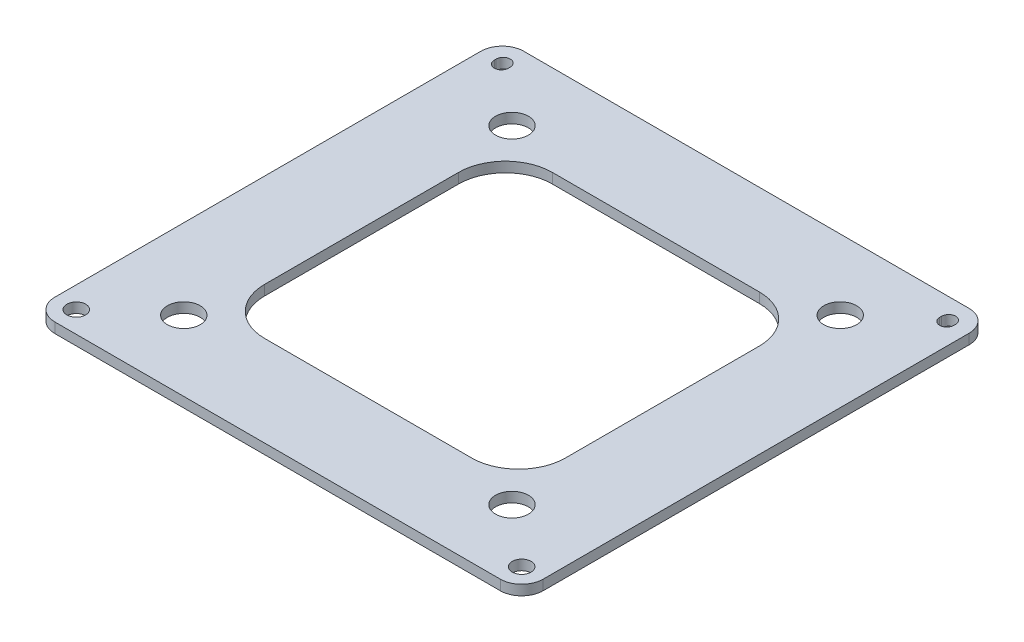
ISO-10303-21;
HEADER;
FILE_DESCRIPTION(('STEP AP214'),'2;1');
FILE_NAME('part.step','',(''),(''),'','','');
FILE_SCHEMA(('AUTOMOTIVE_DESIGN { 1 0 10303 214 1 1 1 1 }'));
ENDSEC;
DATA;
#1=APPLICATION_CONTEXT('core data for automotive mechanical design processes');
#2=APPLICATION_PROTOCOL_DEFINITION('international standard','automotive_design',2000,#1);
#3=PRODUCT_CONTEXT('',#1,'mechanical');
#4=PRODUCT('Part','Part','',(#3));
#5=PRODUCT_RELATED_PRODUCT_CATEGORY('part','',(#4));
#6=PRODUCT_DEFINITION_FORMATION('','',#4);
#7=PRODUCT_DEFINITION_CONTEXT('part definition',#1,'design');
#8=PRODUCT_DEFINITION('design','',#6,#7);
#9=PRODUCT_DEFINITION_SHAPE('','',#8);
#10=(LENGTH_UNIT() NAMED_UNIT(*) SI_UNIT(.MILLI.,.METRE.));
#11=(NAMED_UNIT(*) PLANE_ANGLE_UNIT() SI_UNIT($,.RADIAN.));
#12=(NAMED_UNIT(*) SI_UNIT($,.STERADIAN.) SOLID_ANGLE_UNIT());
#13=UNCERTAINTY_MEASURE_WITH_UNIT(LENGTH_MEASURE(1.E-05),#10,'distance_accuracy_value','');
#14=(GEOMETRIC_REPRESENTATION_CONTEXT(3) GLOBAL_UNCERTAINTY_ASSIGNED_CONTEXT((#13)) GLOBAL_UNIT_ASSIGNED_CONTEXT((#10,
#11,#12)) REPRESENTATION_CONTEXT('',''));
#15=CARTESIAN_POINT('',(0.,0.,0.));
#16=DIRECTION('',(0.,0.,1.));
#17=DIRECTION('',(1.,0.,0.));
#18=AXIS2_PLACEMENT_3D('',#15,#16,#17);
#19=CARTESIAN_POINT('',(-47.5,2.15,45.425));
#20=DIRECTION('',(0.,1.,0.));
#21=DIRECTION('',(0.,0.,1.));
#22=AXIS2_PLACEMENT_3D('',#19,#20,#21);
#23=PLANE('',#22);
#24=CARTESIAN_POINT('',(35.,2.15,35.));
#25=DIRECTION('',(0.,1.,0.));
#26=DIRECTION('',(0.,0.,1.));
#27=AXIS2_PLACEMENT_3D('',#24,#25,#26);
#28=CIRCLE('',#27,3.5);
#29=CARTESIAN_POINT('',(35.,2.15,38.5));
#30=VERTEX_POINT('',#29);
#31=EDGE_CURVE('E764',#30,#30,#28,.T.);
#32=ORIENTED_EDGE('',*,*,#31,.F.);
#33=EDGE_LOOP('',(#32));
#34=FACE_BOUND('',#33,.T.);
#35=CARTESIAN_POINT('',(-35.,2.15,-35.));
#36=DIRECTION('',(0.,1.,0.));
#37=DIRECTION('',(0.,0.,1.));
#38=AXIS2_PLACEMENT_3D('',#35,#36,#37);
#39=CIRCLE('',#38,3.5);
#40=CARTESIAN_POINT('',(-35.,2.15,-31.5));
#41=VERTEX_POINT('',#40);
#42=EDGE_CURVE('E249',#41,#41,#39,.T.);
#43=ORIENTED_EDGE('',*,*,#42,.F.);
#44=EDGE_LOOP('',(#43));
#45=FACE_BOUND('',#44,.T.);
#46=CARTESIAN_POINT('',(47.5,2.15,45.425));
#47=DIRECTION('',(0.,1.,0.));
#48=DIRECTION('',(0.,0.,1.));
#49=AXIS2_PLACEMENT_3D('',#46,#47,#48);
#50=CIRCLE('',#49,2.);
#51=CARTESIAN_POINT('',(47.5,2.15,47.425));
#52=VERTEX_POINT('',#51);
#53=EDGE_CURVE('E344',#52,#52,#50,.T.);
#54=ORIENTED_EDGE('',*,*,#53,.F.);
#55=EDGE_LOOP('',(#54));
#56=FACE_BOUND('',#55,.T.);
#57=CARTESIAN_POINT('',(-47.5,2.15,45.425));
#58=DIRECTION('',(0.,1.,0.));
#59=DIRECTION('',(0.,0.,1.));
#60=AXIS2_PLACEMENT_3D('',#57,#58,#59);
#61=CIRCLE('',#60,4.57499999999999);
#62=CARTESIAN_POINT('',(-52.075,2.15,45.425));
#63=VERTEX_POINT('',#62);
#64=CARTESIAN_POINT('',(-47.5,2.15,50.));
#65=VERTEX_POINT('',#64);
#66=EDGE_CURVE('E395',#63,#65,#61,.T.);
#67=ORIENTED_EDGE('',*,*,#66,.T.);
#68=DIRECTION('',(1.,0.,0.));
#69=VECTOR('',#68,1.);
#70=CARTESIAN_POINT('',(-47.5,2.15,50.));
#71=LINE('',#70,#69);
#72=CARTESIAN_POINT('',(47.5,2.15,50.));
#73=VERTEX_POINT('',#72);
#74=EDGE_CURVE('E399',#65,#73,#71,.T.);
#75=ORIENTED_EDGE('',*,*,#74,.T.);
#76=CARTESIAN_POINT('',(47.5,2.15,45.425));
#77=DIRECTION('',(0.,1.,0.));
#78=DIRECTION('',(0.,0.,1.));
#79=AXIS2_PLACEMENT_3D('',#76,#77,#78);
#80=CIRCLE('',#79,4.575);
#81=CARTESIAN_POINT('',(52.075,2.15,45.425));
#82=VERTEX_POINT('',#81);
#83=EDGE_CURVE('E403',#73,#82,#80,.T.);
#84=ORIENTED_EDGE('',*,*,#83,.T.);
#85=DIRECTION('',(0.,0.,-1.));
#86=VECTOR('',#85,1.);
#87=CARTESIAN_POINT('',(52.075,2.15,-45.425));
#88=LINE('',#87,#86);
#89=CARTESIAN_POINT('',(52.075,2.15,-45.425));
#90=VERTEX_POINT('',#89);
#91=EDGE_CURVE('E406',#82,#90,#88,.T.);
#92=ORIENTED_EDGE('',*,*,#91,.T.);
#93=CARTESIAN_POINT('',(47.5,2.15,-45.425));
#94=DIRECTION('',(0.,1.,0.));
#95=DIRECTION('',(0.,0.,1.));
#96=AXIS2_PLACEMENT_3D('',#93,#94,#95);
#97=CIRCLE('',#96,4.575);
#98=CARTESIAN_POINT('',(47.5,2.15,-50.));
#99=VERTEX_POINT('',#98);
#100=EDGE_CURVE('E409',#90,#99,#97,.T.);
#101=ORIENTED_EDGE('',*,*,#100,.T.);
#102=DIRECTION('',(-1.,0.,0.));
#103=VECTOR('',#102,1.);
#104=CARTESIAN_POINT('',(-47.5,2.15,-50.));
#105=LINE('',#104,#103);
#106=CARTESIAN_POINT('',(-47.5,2.15,-50.));
#107=VERTEX_POINT('',#106);
#108=EDGE_CURVE('E412',#99,#107,#105,.T.);
#109=ORIENTED_EDGE('',*,*,#108,.T.);
#110=CARTESIAN_POINT('',(-47.5,2.15,-45.425));
#111=DIRECTION('',(0.,1.,0.));
#112=DIRECTION('',(0.,0.,1.));
#113=AXIS2_PLACEMENT_3D('',#110,#111,#112);
#114=CIRCLE('',#113,4.57500000000001);
#115=CARTESIAN_POINT('',(-52.075,2.15,-45.425));
#116=VERTEX_POINT('',#115);
#117=EDGE_CURVE('E415',#107,#116,#114,.T.);
#118=ORIENTED_EDGE('',*,*,#117,.T.);
#119=DIRECTION('',(0.,0.,1.));
#120=VECTOR('',#119,1.);
#121=CARTESIAN_POINT('',(-52.075,2.15,-45.425));
#122=LINE('',#121,#120);
#123=EDGE_CURVE('E418',#116,#63,#122,.T.);
#124=ORIENTED_EDGE('',*,*,#123,.T.);
#125=EDGE_LOOP('',(#67,#75,#84,#92,#101,#109,#118,#124));
#126=FACE_BOUND('',#125,.T.);
#127=DIRECTION('',(0.,0.,1.));
#128=VECTOR('',#127,1.);
#129=CARTESIAN_POINT('',(-49.,2.15,-45.225));
#130=LINE('',#129,#128);
#131=CARTESIAN_POINT('',(-49.,2.15,-45.625));
#132=VERTEX_POINT('',#131);
#133=CARTESIAN_POINT('',(-49.,2.15,-45.225));
#134=VERTEX_POINT('',#133);
#135=EDGE_CURVE('E355',#132,#134,#130,.T.);
#136=ORIENTED_EDGE('',*,*,#135,.F.);
#137=CARTESIAN_POINT('',(-47.5,2.15,-45.625));
#138=DIRECTION('',(0.,1.,0.));
#139=DIRECTION('',(0.,0.,1.));
#140=AXIS2_PLACEMENT_3D('',#137,#138,#139);
#141=CIRCLE('',#140,1.5);
#142=CARTESIAN_POINT('',(-46.,2.15,-45.625));
#143=VERTEX_POINT('',#142);
#144=EDGE_CURVE('E352',#143,#132,#141,.T.);
#145=ORIENTED_EDGE('',*,*,#144,.F.);
#146=DIRECTION('',(0.,0.,-1.));
#147=VECTOR('',#146,1.);
#148=CARTESIAN_POINT('',(-46.,2.15,-45.225));
#149=LINE('',#148,#147);
#150=CARTESIAN_POINT('',(-46.,2.15,-45.225));
#151=VERTEX_POINT('',#150);
#152=EDGE_CURVE('E363',#151,#143,#149,.T.);
#153=ORIENTED_EDGE('',*,*,#152,.F.);
#154=CARTESIAN_POINT('',(-47.5,2.15,-45.225));
#155=DIRECTION('',(0.,1.,0.));
#156=DIRECTION('',(0.,0.,1.));
#157=AXIS2_PLACEMENT_3D('',#154,#155,#156);
#158=CIRCLE('',#157,1.5);
#159=EDGE_CURVE('E359',#134,#151,#158,.T.);
#160=ORIENTED_EDGE('',*,*,#159,.F.);
#161=EDGE_LOOP('',(#136,#145,#153,#160));
#162=FACE_BOUND('',#161,.T.);
#163=CARTESIAN_POINT('',(-47.5,2.15,45.425));
#164=DIRECTION('',(0.,1.,0.));
#165=DIRECTION('',(0.,0.,1.));
#166=AXIS2_PLACEMENT_3D('',#163,#164,#165);
#167=CIRCLE('',#166,2.);
#168=CARTESIAN_POINT('',(-47.5,2.15,47.425));
#169=VERTEX_POINT('',#168);
#170=EDGE_CURVE('E336',#169,#169,#167,.T.);
#171=ORIENTED_EDGE('',*,*,#170,.F.);
#172=EDGE_LOOP('',(#171));
#173=FACE_BOUND('',#172,.T.);
#174=DIRECTION('',(0.,0.,1.));
#175=VECTOR('',#174,1.);
#176=CARTESIAN_POINT('',(46.,2.15,-45.225));
#177=LINE('',#176,#175);
#178=CARTESIAN_POINT('',(46.,2.15,-45.625));
#179=VERTEX_POINT('',#178);
#180=CARTESIAN_POINT('',(46.,2.15,-45.225));
#181=VERTEX_POINT('',#180);
#182=EDGE_CURVE('E296',#179,#181,#177,.T.);
#183=ORIENTED_EDGE('',*,*,#182,.F.);
#184=CARTESIAN_POINT('',(47.5,2.15,-45.625));
#185=DIRECTION('',(0.,1.,0.));
#186=DIRECTION('',(0.,0.,-1.));
#187=AXIS2_PLACEMENT_3D('',#184,#185,#186);
#188=CIRCLE('',#187,1.5);
#189=CARTESIAN_POINT('',(49.,2.15,-45.625));
#190=VERTEX_POINT('',#189);
#191=EDGE_CURVE('E293',#190,#179,#188,.T.);
#192=ORIENTED_EDGE('',*,*,#191,.F.);
#193=DIRECTION('',(0.,0.,-1.));
#194=VECTOR('',#193,1.);
#195=CARTESIAN_POINT('',(49.,2.15,-45.225));
#196=LINE('',#195,#194);
#197=CARTESIAN_POINT('',(49.,2.15,-45.225));
#198=VERTEX_POINT('',#197);
#199=EDGE_CURVE('E304',#198,#190,#196,.T.);
#200=ORIENTED_EDGE('',*,*,#199,.F.);
#201=CARTESIAN_POINT('',(47.5,2.15,-45.225));
#202=DIRECTION('',(0.,1.,0.));
#203=DIRECTION('',(0.,0.,-1.));
#204=AXIS2_PLACEMENT_3D('',#201,#202,#203);
#205=CIRCLE('',#204,1.5);
#206=EDGE_CURVE('E300',#181,#198,#205,.T.);
#207=ORIENTED_EDGE('',*,*,#206,.F.);
#208=EDGE_LOOP('',(#183,#192,#200,#207));
#209=FACE_BOUND('',#208,.T.);
#210=DIRECTION('',(1.,0.,0.));
#211=VECTOR('',#210,1.);
#212=CARTESIAN_POINT('',(-22.0749999999999,2.15,30.6738289473684));
#213=LINE('',#212,#211);
#214=CARTESIAN_POINT('',(-22.0749999999999,2.15,30.6738289473684));
#215=VERTEX_POINT('',#214);
#216=CARTESIAN_POINT('',(22.0749999999999,2.15,30.6738289473684));
#217=VERTEX_POINT('',#216);
#218=EDGE_CURVE('E210',#215,#217,#213,.T.);
#219=ORIENTED_EDGE('',*,*,#218,.F.);
#220=CARTESIAN_POINT('',(-22.075,2.15,20.6738289473684));
#221=DIRECTION('',(0.,1.,0.));
#222=DIRECTION('',(0.,0.,-1.));
#223=AXIS2_PLACEMENT_3D('',#220,#221,#222);
#224=CIRCLE('',#223,10.);
#225=CARTESIAN_POINT('',(-32.075,2.15,20.6738289473684));
#226=VERTEX_POINT('',#225);
#227=EDGE_CURVE('E201',#226,#215,#224,.T.);
#228=ORIENTED_EDGE('',*,*,#227,.F.);
#229=DIRECTION('',(0.,0.,1.));
#230=VECTOR('',#229,1.);
#231=CARTESIAN_POINT('',(-32.075,2.15,20.6738289473684));
#232=LINE('',#231,#230);
#233=CARTESIAN_POINT('',(-32.075,2.15,-20.6738289473683));
#234=VERTEX_POINT('',#233);
#235=EDGE_CURVE('E244',#234,#226,#232,.T.);
#236=ORIENTED_EDGE('',*,*,#235,.F.);
#237=CARTESIAN_POINT('',(-22.075,2.15,-20.6738289473684));
#238=DIRECTION('',(0.,1.,0.));
#239=DIRECTION('',(0.,0.,-1.));
#240=AXIS2_PLACEMENT_3D('',#237,#238,#239);
#241=CIRCLE('',#240,10.);
#242=CARTESIAN_POINT('',(-22.0749999999999,2.15,-30.6738289473684));
#243=VERTEX_POINT('',#242);
#244=EDGE_CURVE('E241',#243,#234,#241,.T.);
#245=ORIENTED_EDGE('',*,*,#244,.F.);
#246=DIRECTION('',(-1.,0.,0.));
#247=VECTOR('',#246,1.);
#248=CARTESIAN_POINT('',(-22.0749999999999,2.15,-30.6738289473684));
#249=LINE('',#248,#247);
#250=CARTESIAN_POINT('',(22.0749999999999,2.15,-30.6738289473684));
#251=VERTEX_POINT('',#250);
#252=EDGE_CURVE('E238',#251,#243,#249,.T.);
#253=ORIENTED_EDGE('',*,*,#252,.F.);
#254=CARTESIAN_POINT('',(22.075,2.15,-20.6738289473684));
#255=DIRECTION('',(0.,1.,0.));
#256=DIRECTION('',(0.,0.,-1.));
#257=AXIS2_PLACEMENT_3D('',#254,#255,#256);
#258=CIRCLE('',#257,10.);
#259=CARTESIAN_POINT('',(32.075,2.15,-20.6738289473683));
#260=VERTEX_POINT('',#259);
#261=EDGE_CURVE('E235',#260,#251,#258,.T.);
#262=ORIENTED_EDGE('',*,*,#261,.F.);
#263=DIRECTION('',(0.,0.,-1.));
#264=VECTOR('',#263,1.);
#265=CARTESIAN_POINT('',(32.075,2.15,20.6738289473684));
#266=LINE('',#265,#264);
#267=CARTESIAN_POINT('',(32.075,2.15,20.6738289473684));
#268=VERTEX_POINT('',#267);
#269=EDGE_CURVE('E229',#268,#260,#266,.T.);
#270=ORIENTED_EDGE('',*,*,#269,.F.);
#271=CARTESIAN_POINT('',(22.075,2.15,20.6738289473684));
#272=DIRECTION('',(0.,1.,0.));
#273=DIRECTION('',(0.,0.,1.));
#274=AXIS2_PLACEMENT_3D('',#271,#272,#273);
#275=CIRCLE('',#274,10.);
#276=EDGE_CURVE('E225',#217,#268,#275,.T.);
#277=ORIENTED_EDGE('',*,*,#276,.F.);
#278=EDGE_LOOP('',(#219,#228,#236,#245,#253,#262,#270,#277));
#279=FACE_BOUND('',#278,.T.);
#280=CARTESIAN_POINT('',(35.,2.15,-35.));
#281=DIRECTION('',(0.,1.,0.));
#282=DIRECTION('',(0.,0.,1.));
#283=AXIS2_PLACEMENT_3D('',#280,#281,#282);
#284=CIRCLE('',#283,3.5);
#285=CARTESIAN_POINT('',(35.,2.15,-31.5));
#286=VERTEX_POINT('',#285);
#287=EDGE_CURVE('E772',#286,#286,#284,.T.);
#288=ORIENTED_EDGE('',*,*,#287,.F.);
#289=EDGE_LOOP('',(#288));
#290=FACE_BOUND('',#289,.T.);
#291=CARTESIAN_POINT('',(-35.,2.15,35.));
#292=DIRECTION('',(0.,1.,0.));
#293=DIRECTION('',(0.,0.,1.));
#294=AXIS2_PLACEMENT_3D('',#291,#292,#293);
#295=CIRCLE('',#294,3.5);
#296=CARTESIAN_POINT('',(-35.,2.15,38.5));
#297=VERTEX_POINT('',#296);
#298=EDGE_CURVE('E753',#297,#297,#295,.T.);
#299=ORIENTED_EDGE('',*,*,#298,.F.);
#300=EDGE_LOOP('',(#299));
#301=FACE_BOUND('',#300,.T.);
#302=ADVANCED_FACE('F39',(#34,#45,#56,#126,#162,#173,#209,#279,#290,#301),#23,.T.);
#303=CARTESIAN_POINT('',(-47.5,0.,45.425));
#304=DIRECTION('',(0.,1.,0.));
#305=DIRECTION('',(0.,0.,1.));
#306=AXIS2_PLACEMENT_3D('',#303,#304,#305);
#307=PLANE('',#306);
#308=CARTESIAN_POINT('',(47.5,0.,-45.625));
#309=DIRECTION('',(0.,1.,0.));
#310=DIRECTION('',(0.,0.,-1.));
#311=AXIS2_PLACEMENT_3D('',#308,#309,#310);
#312=CIRCLE('',#311,1.5);
#313=CARTESIAN_POINT('',(49.,0.,-45.625));
#314=VERTEX_POINT('',#313);
#315=CARTESIAN_POINT('',(46.,0.,-45.625));
#316=VERTEX_POINT('',#315);
#317=EDGE_CURVE('E219',#314,#316,#312,.T.);
#318=ORIENTED_EDGE('',*,*,#317,.T.);
#319=DIRECTION('',(0.,0.,1.));
#320=VECTOR('',#319,1.);
#321=CARTESIAN_POINT('',(46.,0.,-45.225));
#322=LINE('',#321,#320);
#323=CARTESIAN_POINT('',(46.,0.,-45.225));
#324=VERTEX_POINT('',#323);
#325=EDGE_CURVE('E311',#316,#324,#322,.T.);
#326=ORIENTED_EDGE('',*,*,#325,.T.);
#327=CARTESIAN_POINT('',(47.5,0.,-45.225));
#328=DIRECTION('',(0.,1.,0.));
#329=DIRECTION('',(0.,0.,-1.));
#330=AXIS2_PLACEMENT_3D('',#327,#328,#329);
#331=CIRCLE('',#330,1.5);
#332=CARTESIAN_POINT('',(49.,0.,-45.225));
#333=VERTEX_POINT('',#332);
#334=EDGE_CURVE('E315',#324,#333,#331,.T.);
#335=ORIENTED_EDGE('',*,*,#334,.T.);
#336=DIRECTION('',(0.,0.,-1.));
#337=VECTOR('',#336,1.);
#338=CARTESIAN_POINT('',(49.,0.,-45.225));
#339=LINE('',#338,#337);
#340=EDGE_CURVE('E297',#333,#314,#339,.T.);
#341=ORIENTED_EDGE('',*,*,#340,.T.);
#342=EDGE_LOOP('',(#318,#326,#335,#341));
#343=FACE_BOUND('',#342,.T.);
#344=CARTESIAN_POINT('',(-47.5,0.,45.425));
#345=DIRECTION('',(0.,1.,0.));
#346=DIRECTION('',(0.,0.,1.));
#347=AXIS2_PLACEMENT_3D('',#344,#345,#346);
#348=CIRCLE('',#347,4.57499999999999);
#349=CARTESIAN_POINT('',(-52.075,0.,45.425));
#350=VERTEX_POINT('',#349);
#351=CARTESIAN_POINT('',(-47.5,0.,50.));
#352=VERTEX_POINT('',#351);
#353=EDGE_CURVE('E394',#350,#352,#348,.T.);
#354=ORIENTED_EDGE('',*,*,#353,.F.);
#355=DIRECTION('',(0.,0.,1.));
#356=VECTOR('',#355,1.);
#357=CARTESIAN_POINT('',(-52.075,0.,-45.425));
#358=LINE('',#357,#356);
#359=CARTESIAN_POINT('',(-52.075,0.,-45.425));
#360=VERTEX_POINT('',#359);
#361=EDGE_CURVE('E400',#360,#350,#358,.T.);
#362=ORIENTED_EDGE('',*,*,#361,.F.);
#363=CARTESIAN_POINT('',(-47.5,0.,-45.425));
#364=DIRECTION('',(0.,1.,0.));
#365=DIRECTION('',(0.,0.,1.));
#366=AXIS2_PLACEMENT_3D('',#363,#364,#365);
#367=CIRCLE('',#366,4.57500000000001);
#368=CARTESIAN_POINT('',(-47.5,0.,-50.));
#369=VERTEX_POINT('',#368);
#370=EDGE_CURVE('E440',#369,#360,#367,.T.);
#371=ORIENTED_EDGE('',*,*,#370,.F.);
#372=DIRECTION('',(-1.,0.,0.));
#373=VECTOR('',#372,1.);
#374=CARTESIAN_POINT('',(-47.5,0.,-50.));
#375=LINE('',#374,#373);
#376=CARTESIAN_POINT('',(47.5,0.,-50.));
#377=VERTEX_POINT('',#376);
#378=EDGE_CURVE('E437',#377,#369,#375,.T.);
#379=ORIENTED_EDGE('',*,*,#378,.F.);
#380=CARTESIAN_POINT('',(47.5,0.,-45.425));
#381=DIRECTION('',(0.,1.,0.));
#382=DIRECTION('',(0.,0.,1.));
#383=AXIS2_PLACEMENT_3D('',#380,#381,#382);
#384=CIRCLE('',#383,4.575);
#385=CARTESIAN_POINT('',(52.075,0.,-45.425));
#386=VERTEX_POINT('',#385);
#387=EDGE_CURVE('E434',#386,#377,#384,.T.);
#388=ORIENTED_EDGE('',*,*,#387,.F.);
#389=DIRECTION('',(0.,0.,-1.));
#390=VECTOR('',#389,1.);
#391=CARTESIAN_POINT('',(52.075,0.,-45.425));
#392=LINE('',#391,#390);
#393=CARTESIAN_POINT('',(52.075,0.,45.425));
#394=VERTEX_POINT('',#393);
#395=EDGE_CURVE('E431',#394,#386,#392,.T.);
#396=ORIENTED_EDGE('',*,*,#395,.F.);
#397=CARTESIAN_POINT('',(47.5,0.,45.425));
#398=DIRECTION('',(0.,1.,0.));
#399=DIRECTION('',(0.,0.,1.));
#400=AXIS2_PLACEMENT_3D('',#397,#398,#399);
#401=CIRCLE('',#400,4.575);
#402=CARTESIAN_POINT('',(47.5,0.,50.));
#403=VERTEX_POINT('',#402);
#404=EDGE_CURVE('E428',#403,#394,#401,.T.);
#405=ORIENTED_EDGE('',*,*,#404,.F.);
#406=DIRECTION('',(1.,0.,0.));
#407=VECTOR('',#406,1.);
#408=CARTESIAN_POINT('',(-47.5,0.,50.));
#409=LINE('',#408,#407);
#410=EDGE_CURVE('E425',#352,#403,#409,.T.);
#411=ORIENTED_EDGE('',*,*,#410,.F.);
#412=EDGE_LOOP('',(#354,#362,#371,#379,#388,#396,#405,#411));
#413=FACE_BOUND('',#412,.T.);
#414=CARTESIAN_POINT('',(-47.5,0.,-45.625));
#415=DIRECTION('',(0.,1.,0.));
#416=DIRECTION('',(0.,0.,1.));
#417=AXIS2_PLACEMENT_3D('',#414,#415,#416);
#418=CIRCLE('',#417,1.5);
#419=CARTESIAN_POINT('',(-46.,0.,-45.625));
#420=VERTEX_POINT('',#419);
#421=CARTESIAN_POINT('',(-49.,0.,-45.625));
#422=VERTEX_POINT('',#421);
#423=EDGE_CURVE('E348',#420,#422,#418,.T.);
#424=ORIENTED_EDGE('',*,*,#423,.T.);
#425=DIRECTION('',(0.,0.,1.));
#426=VECTOR('',#425,1.);
#427=CARTESIAN_POINT('',(-49.,0.,-45.225));
#428=LINE('',#427,#426);
#429=CARTESIAN_POINT('',(-49.,0.,-45.225));
#430=VERTEX_POINT('',#429);
#431=EDGE_CURVE('E370',#422,#430,#428,.T.);
#432=ORIENTED_EDGE('',*,*,#431,.T.);
#433=CARTESIAN_POINT('',(-47.5,0.,-45.225));
#434=DIRECTION('',(0.,1.,0.));
#435=DIRECTION('',(0.,0.,1.));
#436=AXIS2_PLACEMENT_3D('',#433,#434,#435);
#437=CIRCLE('',#436,1.5);
#438=CARTESIAN_POINT('',(-46.,0.,-45.225));
#439=VERTEX_POINT('',#438);
#440=EDGE_CURVE('E374',#430,#439,#437,.T.);
#441=ORIENTED_EDGE('',*,*,#440,.T.);
#442=DIRECTION('',(0.,0.,-1.));
#443=VECTOR('',#442,1.);
#444=CARTESIAN_POINT('',(-46.,0.,-45.225));
#445=LINE('',#444,#443);
#446=EDGE_CURVE('E356',#439,#420,#445,.T.);
#447=ORIENTED_EDGE('',*,*,#446,.T.);
#448=EDGE_LOOP('',(#424,#432,#441,#447));
#449=FACE_BOUND('',#448,.T.);
#450=CARTESIAN_POINT('',(47.5,0.,45.425));
#451=DIRECTION('',(0.,1.,0.));
#452=DIRECTION('',(0.,0.,1.));
#453=AXIS2_PLACEMENT_3D('',#450,#451,#452);
#454=CIRCLE('',#453,2.);
#455=CARTESIAN_POINT('',(47.5,0.,47.425));
#456=VERTEX_POINT('',#455);
#457=EDGE_CURVE('E340',#456,#456,#454,.T.);
#458=ORIENTED_EDGE('',*,*,#457,.T.);
#459=EDGE_LOOP('',(#458));
#460=FACE_BOUND('',#459,.T.);
#461=CARTESIAN_POINT('',(-47.5,0.,45.425));
#462=DIRECTION('',(0.,1.,0.));
#463=DIRECTION('',(0.,0.,1.));
#464=AXIS2_PLACEMENT_3D('',#461,#462,#463);
#465=CIRCLE('',#464,2.);
#466=CARTESIAN_POINT('',(-47.5,0.,47.425));
#467=VERTEX_POINT('',#466);
#468=EDGE_CURVE('E335',#467,#467,#465,.T.);
#469=ORIENTED_EDGE('',*,*,#468,.T.);
#470=EDGE_LOOP('',(#469));
#471=FACE_BOUND('',#470,.T.);
#472=CARTESIAN_POINT('',(-22.075,0.,20.6738289473684));
#473=DIRECTION('',(0.,1.,0.));
#474=DIRECTION('',(0.,0.,-1.));
#475=AXIS2_PLACEMENT_3D('',#472,#473,#474);
#476=CIRCLE('',#475,10.);
#477=CARTESIAN_POINT('',(-32.075,0.,20.6738289473684));
#478=VERTEX_POINT('',#477);
#479=CARTESIAN_POINT('',(-22.0749999999999,0.,30.6738289473684));
#480=VERTEX_POINT('',#479);
#481=EDGE_CURVE('E63',#478,#480,#476,.T.);
#482=ORIENTED_EDGE('',*,*,#481,.T.);
#483=DIRECTION('',(1.,0.,0.));
#484=VECTOR('',#483,1.);
#485=CARTESIAN_POINT('',(-22.0749999999999,0.,30.6738289473684));
#486=LINE('',#485,#484);
#487=CARTESIAN_POINT('',(22.0749999999999,0.,30.6738289473684));
#488=VERTEX_POINT('',#487);
#489=EDGE_CURVE('E217',#480,#488,#486,.T.);
#490=ORIENTED_EDGE('',*,*,#489,.T.);
#491=CARTESIAN_POINT('',(22.075,0.,20.6738289473684));
#492=DIRECTION('',(0.,1.,0.));
#493=DIRECTION('',(0.,0.,1.));
#494=AXIS2_PLACEMENT_3D('',#491,#492,#493);
#495=CIRCLE('',#494,10.);
#496=CARTESIAN_POINT('',(32.075,0.,20.6738289473684));
#497=VERTEX_POINT('',#496);
#498=EDGE_CURVE('E252',#488,#497,#495,.T.);
#499=ORIENTED_EDGE('',*,*,#498,.T.);
#500=DIRECTION('',(0.,0.,-1.));
#501=VECTOR('',#500,1.);
#502=CARTESIAN_POINT('',(32.075,0.,20.6738289473684));
#503=LINE('',#502,#501);
#504=CARTESIAN_POINT('',(32.075,0.,-20.6738289473683));
#505=VERTEX_POINT('',#504);
#506=EDGE_CURVE('E256',#497,#505,#503,.T.);
#507=ORIENTED_EDGE('',*,*,#506,.T.);
#508=CARTESIAN_POINT('',(22.075,0.,-20.6738289473684));
#509=DIRECTION('',(0.,1.,0.));
#510=DIRECTION('',(0.,0.,-1.));
#511=AXIS2_PLACEMENT_3D('',#508,#509,#510);
#512=CIRCLE('',#511,10.);
#513=CARTESIAN_POINT('',(22.0749999999999,0.,-30.6738289473684));
#514=VERTEX_POINT('',#513);
#515=EDGE_CURVE('E260',#505,#514,#512,.T.);
#516=ORIENTED_EDGE('',*,*,#515,.T.);
#517=DIRECTION('',(-1.,0.,0.));
#518=VECTOR('',#517,1.);
#519=CARTESIAN_POINT('',(-22.0749999999999,0.,-30.6738289473684));
#520=LINE('',#519,#518);
#521=CARTESIAN_POINT('',(-22.0749999999999,0.,-30.6738289473684));
#522=VERTEX_POINT('',#521);
#523=EDGE_CURVE('E264',#514,#522,#520,.T.);
#524=ORIENTED_EDGE('',*,*,#523,.T.);
#525=CARTESIAN_POINT('',(-22.075,0.,-20.6738289473684));
#526=DIRECTION('',(0.,1.,0.));
#527=DIRECTION('',(0.,0.,-1.));
#528=AXIS2_PLACEMENT_3D('',#525,#526,#527);
#529=CIRCLE('',#528,10.);
#530=CARTESIAN_POINT('',(-32.075,0.,-20.6738289473683));
#531=VERTEX_POINT('',#530);
#532=EDGE_CURVE('E268',#522,#531,#529,.T.);
#533=ORIENTED_EDGE('',*,*,#532,.T.);
#534=DIRECTION('',(0.,0.,1.));
#535=VECTOR('',#534,1.);
#536=CARTESIAN_POINT('',(-32.075,0.,20.6738289473684));
#537=LINE('',#536,#535);
#538=EDGE_CURVE('E211',#531,#478,#537,.T.);
#539=ORIENTED_EDGE('',*,*,#538,.T.);
#540=EDGE_LOOP('',(#482,#490,#499,#507,#516,#524,#533,#539));
#541=FACE_BOUND('',#540,.T.);
#542=CARTESIAN_POINT('',(-35.,0.,-35.));
#543=DIRECTION('',(0.,1.,0.));
#544=DIRECTION('',(0.,0.,1.));
#545=AXIS2_PLACEMENT_3D('',#542,#543,#544);
#546=CIRCLE('',#545,3.5);
#547=CARTESIAN_POINT('',(-35.,0.,-31.5));
#548=VERTEX_POINT('',#547);
#549=EDGE_CURVE('E776',#548,#548,#546,.T.);
#550=ORIENTED_EDGE('',*,*,#549,.T.);
#551=EDGE_LOOP('',(#550));
#552=FACE_BOUND('',#551,.T.);
#553=CARTESIAN_POINT('',(35.,0.,-35.));
#554=DIRECTION('',(0.,1.,0.));
#555=DIRECTION('',(0.,0.,1.));
#556=AXIS2_PLACEMENT_3D('',#553,#554,#555);
#557=CIRCLE('',#556,3.5);
#558=CARTESIAN_POINT('',(35.,0.,-31.5));
#559=VERTEX_POINT('',#558);
#560=EDGE_CURVE('E768',#559,#559,#557,.T.);
#561=ORIENTED_EDGE('',*,*,#560,.T.);
#562=EDGE_LOOP('',(#561));
#563=FACE_BOUND('',#562,.T.);
#564=CARTESIAN_POINT('',(35.,0.,35.));
#565=DIRECTION('',(0.,1.,0.));
#566=DIRECTION('',(0.,0.,1.));
#567=AXIS2_PLACEMENT_3D('',#564,#565,#566);
#568=CIRCLE('',#567,3.5);
#569=CARTESIAN_POINT('',(35.,0.,38.5));
#570=VERTEX_POINT('',#569);
#571=EDGE_CURVE('E761',#570,#570,#568,.T.);
#572=ORIENTED_EDGE('',*,*,#571,.T.);
#573=EDGE_LOOP('',(#572));
#574=FACE_BOUND('',#573,.T.);
#575=CARTESIAN_POINT('',(-35.,0.,35.));
#576=DIRECTION('',(0.,1.,0.));
#577=DIRECTION('',(0.,0.,1.));
#578=AXIS2_PLACEMENT_3D('',#575,#576,#577);
#579=CIRCLE('',#578,3.5);
#580=CARTESIAN_POINT('',(-35.,0.,38.5));
#581=VERTEX_POINT('',#580);
#582=EDGE_CURVE('E756',#581,#581,#579,.T.);
#583=ORIENTED_EDGE('',*,*,#582,.T.);
#584=EDGE_LOOP('',(#583));
#585=FACE_BOUND('',#584,.T.);
#586=ADVANCED_FACE('F479',(#343,#413,#449,#460,#471,#541,#552,#563,#574,#585),#307,.F.);
#587=CARTESIAN_POINT('',(-47.5,2.15,45.425));
#588=DIRECTION('',(0.,-1.,0.));
#589=DIRECTION('',(0.,0.,-1.));
#590=AXIS2_PLACEMENT_3D('',#587,#588,#589);
#591=CYLINDRICAL_SURFACE('',#590,4.57499999999999);
#592=ORIENTED_EDGE('',*,*,#353,.T.);
#593=DIRECTION('',(0.,-1.,0.));
#594=VECTOR('',#593,1.);
#595=CARTESIAN_POINT('',(-47.5,2.15,50.));
#596=LINE('',#595,#594);
#597=EDGE_CURVE('E11',#65,#352,#596,.T.);
#598=ORIENTED_EDGE('',*,*,#597,.F.);
#599=ORIENTED_EDGE('',*,*,#66,.F.);
#600=DIRECTION('',(0.,-1.,0.));
#601=VECTOR('',#600,1.);
#602=CARTESIAN_POINT('',(-52.075,2.15,45.425));
#603=LINE('',#602,#601);
#604=EDGE_CURVE('E421',#63,#350,#603,.T.);
#605=ORIENTED_EDGE('',*,*,#604,.T.);
#606=EDGE_LOOP('',(#592,#598,#599,#605));
#607=FACE_BOUND('',#606,.T.);
#608=ADVANCED_FACE('F41',(#607),#591,.T.);
#609=CARTESIAN_POINT('',(-47.5,2.15,50.));
#610=DIRECTION('',(0.,0.,-1.));
#611=DIRECTION('',(-1.,0.,0.));
#612=AXIS2_PLACEMENT_3D('',#609,#610,#611);
#613=PLANE('',#612);
#614=ORIENTED_EDGE('',*,*,#410,.T.);
#615=DIRECTION('',(0.,-1.,0.));
#616=VECTOR('',#615,1.);
#617=CARTESIAN_POINT('',(47.5,2.15,50.));
#618=LINE('',#617,#616);
#619=EDGE_CURVE('E48',#73,#403,#618,.T.);
#620=ORIENTED_EDGE('',*,*,#619,.F.);
#621=ORIENTED_EDGE('',*,*,#74,.F.);
#622=ORIENTED_EDGE('',*,*,#597,.T.);
#623=EDGE_LOOP('',(#614,#620,#621,#622));
#624=FACE_BOUND('',#623,.T.);
#625=ADVANCED_FACE('F497',(#624),#613,.F.);
#626=CARTESIAN_POINT('',(47.5,2.15,45.425));
#627=DIRECTION('',(0.,-1.,0.));
#628=DIRECTION('',(0.,0.,-1.));
#629=AXIS2_PLACEMENT_3D('',#626,#627,#628);
#630=CYLINDRICAL_SURFACE('',#629,4.575);
#631=ORIENTED_EDGE('',*,*,#404,.T.);
#632=DIRECTION('',(0.,-1.,0.));
#633=VECTOR('',#632,1.);
#634=CARTESIAN_POINT('',(52.075,2.15,45.425));
#635=LINE('',#634,#633);
#636=EDGE_CURVE('E464',#82,#394,#635,.T.);
#637=ORIENTED_EDGE('',*,*,#636,.F.);
#638=ORIENTED_EDGE('',*,*,#83,.F.);
#639=ORIENTED_EDGE('',*,*,#619,.T.);
#640=EDGE_LOOP('',(#631,#637,#638,#639));
#641=FACE_BOUND('',#640,.T.);
#642=ADVANCED_FACE('F473',(#641),#630,.T.);
#643=CARTESIAN_POINT('',(52.075,2.15,-45.425));
#644=DIRECTION('',(-1.,0.,0.));
#645=DIRECTION('',(0.,0.,1.));
#646=AXIS2_PLACEMENT_3D('',#643,#644,#645);
#647=PLANE('',#646);
#648=ORIENTED_EDGE('',*,*,#395,.T.);
#649=DIRECTION('',(0.,-1.,0.));
#650=VECTOR('',#649,1.);
#651=CARTESIAN_POINT('',(52.075,2.15,-45.425));
#652=LINE('',#651,#650);
#653=EDGE_CURVE('E460',#90,#386,#652,.T.);
#654=ORIENTED_EDGE('',*,*,#653,.F.);
#655=ORIENTED_EDGE('',*,*,#91,.F.);
#656=ORIENTED_EDGE('',*,*,#636,.T.);
#657=EDGE_LOOP('',(#648,#654,#655,#656));
#658=FACE_BOUND('',#657,.T.);
#659=ADVANCED_FACE('F485',(#658),#647,.F.);
#660=CARTESIAN_POINT('',(47.5,2.15,-45.425));
#661=DIRECTION('',(0.,-1.,0.));
#662=DIRECTION('',(0.,0.,-1.));
#663=AXIS2_PLACEMENT_3D('',#660,#661,#662);
#664=CYLINDRICAL_SURFACE('',#663,4.575);
#665=ORIENTED_EDGE('',*,*,#387,.T.);
#666=DIRECTION('',(0.,-1.,0.));
#667=VECTOR('',#666,1.);
#668=CARTESIAN_POINT('',(47.5,2.15,-50.));
#669=LINE('',#668,#667);
#670=EDGE_CURVE('E456',#99,#377,#669,.T.);
#671=ORIENTED_EDGE('',*,*,#670,.F.);
#672=ORIENTED_EDGE('',*,*,#100,.F.);
#673=ORIENTED_EDGE('',*,*,#653,.T.);
#674=EDGE_LOOP('',(#665,#671,#672,#673));
#675=FACE_BOUND('',#674,.T.);
#676=ADVANCED_FACE('F489',(#675),#664,.T.);
#677=CARTESIAN_POINT('',(-47.5,2.15,-50.));
#678=DIRECTION('',(0.,0.,1.));
#679=DIRECTION('',(1.,0.,0.));
#680=AXIS2_PLACEMENT_3D('',#677,#678,#679);
#681=PLANE('',#680);
#682=ORIENTED_EDGE('',*,*,#378,.T.);
#683=DIRECTION('',(0.,-1.,0.));
#684=VECTOR('',#683,1.);
#685=CARTESIAN_POINT('',(-47.5,2.15,-50.));
#686=LINE('',#685,#684);
#687=EDGE_CURVE('E452',#107,#369,#686,.T.);
#688=ORIENTED_EDGE('',*,*,#687,.F.);
#689=ORIENTED_EDGE('',*,*,#108,.F.);
#690=ORIENTED_EDGE('',*,*,#670,.T.);
#691=EDGE_LOOP('',(#682,#688,#689,#690));
#692=FACE_BOUND('',#691,.T.);
#693=ADVANCED_FACE('F510',(#692),#681,.F.);
#694=CARTESIAN_POINT('',(-47.5,2.15,-45.425));
#695=DIRECTION('',(0.,-1.,0.));
#696=DIRECTION('',(0.,0.,-1.));
#697=AXIS2_PLACEMENT_3D('',#694,#695,#696);
#698=CYLINDRICAL_SURFACE('',#697,4.57500000000001);
#699=ORIENTED_EDGE('',*,*,#370,.T.);
#700=DIRECTION('',(0.,-1.,0.));
#701=VECTOR('',#700,1.);
#702=CARTESIAN_POINT('',(-52.075,2.15,-45.425));
#703=LINE('',#702,#701);
#704=EDGE_CURVE('E448',#116,#360,#703,.T.);
#705=ORIENTED_EDGE('',*,*,#704,.F.);
#706=ORIENTED_EDGE('',*,*,#117,.F.);
#707=ORIENTED_EDGE('',*,*,#687,.T.);
#708=EDGE_LOOP('',(#699,#705,#706,#707));
#709=FACE_BOUND('',#708,.T.);
#710=ADVANCED_FACE('F508',(#709),#698,.T.);
#711=CARTESIAN_POINT('',(-52.075,2.15,-45.425));
#712=DIRECTION('',(1.,0.,0.));
#713=DIRECTION('',(0.,0.,-1.));
#714=AXIS2_PLACEMENT_3D('',#711,#712,#713);
#715=PLANE('',#714);
#716=ORIENTED_EDGE('',*,*,#361,.T.);
#717=ORIENTED_EDGE('',*,*,#604,.F.);
#718=ORIENTED_EDGE('',*,*,#123,.F.);
#719=ORIENTED_EDGE('',*,*,#704,.T.);
#720=EDGE_LOOP('',(#716,#717,#718,#719));
#721=FACE_BOUND('',#720,.T.);
#722=ADVANCED_FACE('F503',(#721),#715,.F.);
#723=CARTESIAN_POINT('',(-47.5,2.15,-45.625));
#724=DIRECTION('',(0.,-1.,0.));
#725=DIRECTION('',(0.,0.,-1.));
#726=AXIS2_PLACEMENT_3D('',#723,#724,#725);
#727=CYLINDRICAL_SURFACE('',#726,1.5);
#728=ORIENTED_EDGE('',*,*,#423,.F.);
#729=DIRECTION('',(0.,-1.,0.));
#730=VECTOR('',#729,1.);
#731=CARTESIAN_POINT('',(-46.,2.15,-45.625));
#732=LINE('',#731,#730);
#733=EDGE_CURVE('E366',#143,#420,#732,.T.);
#734=ORIENTED_EDGE('',*,*,#733,.F.);
#735=ORIENTED_EDGE('',*,*,#144,.T.);
#736=DIRECTION('',(0.,-1.,0.));
#737=VECTOR('',#736,1.);
#738=CARTESIAN_POINT('',(-49.,2.15,-45.625));
#739=LINE('',#738,#737);
#740=EDGE_CURVE('E390',#132,#422,#739,.T.);
#741=ORIENTED_EDGE('',*,*,#740,.T.);
#742=EDGE_LOOP('',(#728,#734,#735,#741));
#743=FACE_BOUND('',#742,.T.);
#744=ADVANCED_FACE('F530',(#743),#727,.F.);
#745=CARTESIAN_POINT('',(-49.,2.15,-45.225));
#746=DIRECTION('',(1.,0.,0.));
#747=DIRECTION('',(0.,0.,-1.));
#748=AXIS2_PLACEMENT_3D('',#745,#746,#747);
#749=PLANE('',#748);
#750=ORIENTED_EDGE('',*,*,#431,.F.);
#751=ORIENTED_EDGE('',*,*,#740,.F.);
#752=ORIENTED_EDGE('',*,*,#135,.T.);
#753=DIRECTION('',(0.,-1.,0.));
#754=VECTOR('',#753,1.);
#755=CARTESIAN_POINT('',(-49.,2.15,-45.225));
#756=LINE('',#755,#754);
#757=EDGE_CURVE('E387',#134,#430,#756,.T.);
#758=ORIENTED_EDGE('',*,*,#757,.T.);
#759=EDGE_LOOP('',(#750,#751,#752,#758));
#760=FACE_BOUND('',#759,.T.);
#761=ADVANCED_FACE('F537',(#760),#749,.T.);
#762=CARTESIAN_POINT('',(-47.5,2.15,-45.225));
#763=DIRECTION('',(0.,-1.,0.));
#764=DIRECTION('',(0.,0.,-1.));
#765=AXIS2_PLACEMENT_3D('',#762,#763,#764);
#766=CYLINDRICAL_SURFACE('',#765,1.5);
#767=ORIENTED_EDGE('',*,*,#440,.F.);
#768=ORIENTED_EDGE('',*,*,#757,.F.);
#769=ORIENTED_EDGE('',*,*,#159,.T.);
#770=DIRECTION('',(0.,-1.,0.));
#771=VECTOR('',#770,1.);
#772=CARTESIAN_POINT('',(-46.,2.15,-45.225));
#773=LINE('',#772,#771);
#774=EDGE_CURVE('E384',#151,#439,#773,.T.);
#775=ORIENTED_EDGE('',*,*,#774,.T.);
#776=EDGE_LOOP('',(#767,#768,#769,#775));
#777=FACE_BOUND('',#776,.T.);
#778=ADVANCED_FACE('F542',(#777),#766,.F.);
#779=CARTESIAN_POINT('',(-46.,2.15,-45.225));
#780=DIRECTION('',(-1.,0.,0.));
#781=DIRECTION('',(0.,0.,1.));
#782=AXIS2_PLACEMENT_3D('',#779,#780,#781);
#783=PLANE('',#782);
#784=ORIENTED_EDGE('',*,*,#446,.F.);
#785=ORIENTED_EDGE('',*,*,#774,.F.);
#786=ORIENTED_EDGE('',*,*,#152,.T.);
#787=ORIENTED_EDGE('',*,*,#733,.T.);
#788=EDGE_LOOP('',(#784,#785,#786,#787));
#789=FACE_BOUND('',#788,.T.);
#790=ADVANCED_FACE('F549',(#789),#783,.T.);
#791=CARTESIAN_POINT('',(47.5,2.15,45.425));
#792=DIRECTION('',(0.,-1.,0.));
#793=DIRECTION('',(0.,0.,-1.));
#794=AXIS2_PLACEMENT_3D('',#791,#792,#793);
#795=CYLINDRICAL_SURFACE('',#794,2.);
#796=ORIENTED_EDGE('',*,*,#53,.T.);
#797=EDGE_LOOP('',(#796));
#798=FACE_BOUND('',#797,.T.);
#799=ORIENTED_EDGE('',*,*,#457,.F.);
#800=EDGE_LOOP('',(#799));
#801=FACE_BOUND('',#800,.T.);
#802=ADVANCED_FACE('F594',(#798,#801),#795,.F.);
#803=CARTESIAN_POINT('',(-47.5,2.15,45.425));
#804=DIRECTION('',(0.,-1.,0.));
#805=DIRECTION('',(0.,0.,-1.));
#806=AXIS2_PLACEMENT_3D('',#803,#804,#805);
#807=CYLINDRICAL_SURFACE('',#806,2.);
#808=ORIENTED_EDGE('',*,*,#170,.T.);
#809=EDGE_LOOP('',(#808));
#810=FACE_BOUND('',#809,.T.);
#811=ORIENTED_EDGE('',*,*,#468,.F.);
#812=EDGE_LOOP('',(#811));
#813=FACE_BOUND('',#812,.T.);
#814=ADVANCED_FACE('F591',(#810,#813),#807,.F.);
#815=CARTESIAN_POINT('',(47.5,2.15,-45.625));
#816=DIRECTION('',(0.,-1.,0.));
#817=DIRECTION('',(0.,0.,-1.));
#818=AXIS2_PLACEMENT_3D('',#815,#816,#817);
#819=CYLINDRICAL_SURFACE('',#818,1.5);
#820=ORIENTED_EDGE('',*,*,#317,.F.);
#821=DIRECTION('',(0.,-1.,0.));
#822=VECTOR('',#821,1.);
#823=CARTESIAN_POINT('',(49.,2.15,-45.625));
#824=LINE('',#823,#822);
#825=EDGE_CURVE('E307',#190,#314,#824,.T.);
#826=ORIENTED_EDGE('',*,*,#825,.F.);
#827=ORIENTED_EDGE('',*,*,#191,.T.);
#828=DIRECTION('',(0.,-1.,0.));
#829=VECTOR('',#828,1.);
#830=CARTESIAN_POINT('',(46.,2.15,-45.625));
#831=LINE('',#830,#829);
#832=EDGE_CURVE('E331',#179,#316,#831,.T.);
#833=ORIENTED_EDGE('',*,*,#832,.T.);
#834=EDGE_LOOP('',(#820,#826,#827,#833));
#835=FACE_BOUND('',#834,.T.);
#836=ADVANCED_FACE('F573',(#835),#819,.F.);
#837=CARTESIAN_POINT('',(46.,2.15,-45.225));
#838=DIRECTION('',(1.,0.,0.));
#839=DIRECTION('',(0.,0.,-1.));
#840=AXIS2_PLACEMENT_3D('',#837,#838,#839);
#841=PLANE('',#840);
#842=ORIENTED_EDGE('',*,*,#325,.F.);
#843=ORIENTED_EDGE('',*,*,#832,.F.);
#844=ORIENTED_EDGE('',*,*,#182,.T.);
#845=DIRECTION('',(0.,-1.,0.));
#846=VECTOR('',#845,1.);
#847=CARTESIAN_POINT('',(46.,2.15,-45.225));
#848=LINE('',#847,#846);
#849=EDGE_CURVE('E328',#181,#324,#848,.T.);
#850=ORIENTED_EDGE('',*,*,#849,.T.);
#851=EDGE_LOOP('',(#842,#843,#844,#850));
#852=FACE_BOUND('',#851,.T.);
#853=ADVANCED_FACE('F567',(#852),#841,.T.);
#854=CARTESIAN_POINT('',(47.5,2.15,-45.225));
#855=DIRECTION('',(0.,-1.,0.));
#856=DIRECTION('',(0.,0.,-1.));
#857=AXIS2_PLACEMENT_3D('',#854,#855,#856);
#858=CYLINDRICAL_SURFACE('',#857,1.5);
#859=ORIENTED_EDGE('',*,*,#334,.F.);
#860=ORIENTED_EDGE('',*,*,#849,.F.);
#861=ORIENTED_EDGE('',*,*,#206,.T.);
#862=DIRECTION('',(0.,-1.,0.));
#863=VECTOR('',#862,1.);
#864=CARTESIAN_POINT('',(49.,2.15,-45.225));
#865=LINE('',#864,#863);
#866=EDGE_CURVE('E325',#198,#333,#865,.T.);
#867=ORIENTED_EDGE('',*,*,#866,.T.);
#868=EDGE_LOOP('',(#859,#860,#861,#867));
#869=FACE_BOUND('',#868,.T.);
#870=ADVANCED_FACE('F570',(#869),#858,.F.);
#871=CARTESIAN_POINT('',(49.,2.15,-45.225));
#872=DIRECTION('',(-1.,0.,0.));
#873=DIRECTION('',(0.,0.,1.));
#874=AXIS2_PLACEMENT_3D('',#871,#872,#873);
#875=PLANE('',#874);
#876=ORIENTED_EDGE('',*,*,#340,.F.);
#877=ORIENTED_EDGE('',*,*,#866,.F.);
#878=ORIENTED_EDGE('',*,*,#199,.T.);
#879=ORIENTED_EDGE('',*,*,#825,.T.);
#880=EDGE_LOOP('',(#876,#877,#878,#879));
#881=FACE_BOUND('',#880,.T.);
#882=ADVANCED_FACE('F576',(#881),#875,.T.);
#883=CARTESIAN_POINT('',(-22.075,2.15,20.6738289473684));
#884=DIRECTION('',(0.,-1.,0.));
#885=DIRECTION('',(0.,0.,-1.));
#886=AXIS2_PLACEMENT_3D('',#883,#884,#885);
#887=CYLINDRICAL_SURFACE('',#886,10.);
#888=ORIENTED_EDGE('',*,*,#481,.F.);
#889=DIRECTION('',(0.,-1.,0.));
#890=VECTOR('',#889,1.);
#891=CARTESIAN_POINT('',(-32.075,2.15,20.6738289473684));
#892=LINE('',#891,#890);
#893=EDGE_CURVE('E205',#226,#478,#892,.T.);
#894=ORIENTED_EDGE('',*,*,#893,.F.);
#895=ORIENTED_EDGE('',*,*,#227,.T.);
#896=DIRECTION('',(0.,-1.,0.));
#897=VECTOR('',#896,1.);
#898=CARTESIAN_POINT('',(-22.0749999999999,2.15,30.6738289473684));
#899=LINE('',#898,#897);
#900=EDGE_CURVE('E204',#215,#480,#899,.T.);
#901=ORIENTED_EDGE('',*,*,#900,.T.);
#902=EDGE_LOOP('',(#888,#894,#895,#901));
#903=FACE_BOUND('',#902,.T.);
#904=ADVANCED_FACE('F203',(#903),#887,.F.);
#905=CARTESIAN_POINT('',(-22.0749999999999,2.15,30.6738289473684));
#906=DIRECTION('',(0.,0.,-1.));
#907=DIRECTION('',(-1.,0.,0.));
#908=AXIS2_PLACEMENT_3D('',#905,#906,#907);
#909=PLANE('',#908);
#910=ORIENTED_EDGE('',*,*,#489,.F.);
#911=ORIENTED_EDGE('',*,*,#900,.F.);
#912=ORIENTED_EDGE('',*,*,#218,.T.);
#913=DIRECTION('',(0.,-1.,0.));
#914=VECTOR('',#913,1.);
#915=CARTESIAN_POINT('',(22.0749999999999,2.15,30.6738289473684));
#916=LINE('',#915,#914);
#917=EDGE_CURVE('E220',#217,#488,#916,.T.);
#918=ORIENTED_EDGE('',*,*,#917,.T.);
#919=EDGE_LOOP('',(#910,#911,#912,#918));
#920=FACE_BOUND('',#919,.T.);
#921=ADVANCED_FACE('F214',(#920),#909,.T.);
#922=CARTESIAN_POINT('',(22.075,2.15,20.6738289473684));
#923=DIRECTION('',(0.,-1.,0.));
#924=DIRECTION('',(0.,0.,-1.));
#925=AXIS2_PLACEMENT_3D('',#922,#923,#924);
#926=CYLINDRICAL_SURFACE('',#925,10.);
#927=ORIENTED_EDGE('',*,*,#498,.F.);
#928=ORIENTED_EDGE('',*,*,#917,.F.);
#929=ORIENTED_EDGE('',*,*,#276,.T.);
#930=DIRECTION('',(0.,-1.,0.));
#931=VECTOR('',#930,1.);
#932=CARTESIAN_POINT('',(32.075,2.15,20.6738289473684));
#933=LINE('',#932,#931);
#934=EDGE_CURVE('E288',#268,#497,#933,.T.);
#935=ORIENTED_EDGE('',*,*,#934,.T.);
#936=EDGE_LOOP('',(#927,#928,#929,#935));
#937=FACE_BOUND('',#936,.T.);
#938=ADVANCED_FACE('F649',(#937),#926,.F.);
#939=CARTESIAN_POINT('',(32.075,2.15,20.6738289473684));
#940=DIRECTION('',(-1.,0.,0.));
#941=DIRECTION('',(0.,0.,1.));
#942=AXIS2_PLACEMENT_3D('',#939,#940,#941);
#943=PLANE('',#942);
#944=ORIENTED_EDGE('',*,*,#506,.F.);
#945=ORIENTED_EDGE('',*,*,#934,.F.);
#946=ORIENTED_EDGE('',*,*,#269,.T.);
#947=DIRECTION('',(0.,-1.,0.));
#948=VECTOR('',#947,1.);
#949=CARTESIAN_POINT('',(32.075,2.15,-20.6738289473683));
#950=LINE('',#949,#948);
#951=EDGE_CURVE('E285',#260,#505,#950,.T.);
#952=ORIENTED_EDGE('',*,*,#951,.T.);
#953=EDGE_LOOP('',(#944,#945,#946,#952));
#954=FACE_BOUND('',#953,.T.);
#955=ADVANCED_FACE('F657',(#954),#943,.T.);
#956=CARTESIAN_POINT('',(22.075,2.15,-20.6738289473684));
#957=DIRECTION('',(0.,-1.,0.));
#958=DIRECTION('',(0.,0.,-1.));
#959=AXIS2_PLACEMENT_3D('',#956,#957,#958);
#960=CYLINDRICAL_SURFACE('',#959,10.);
#961=ORIENTED_EDGE('',*,*,#515,.F.);
#962=ORIENTED_EDGE('',*,*,#951,.F.);
#963=ORIENTED_EDGE('',*,*,#261,.T.);
#964=DIRECTION('',(0.,-1.,0.));
#965=VECTOR('',#964,1.);
#966=CARTESIAN_POINT('',(22.0749999999999,2.15,-30.6738289473684));
#967=LINE('',#966,#965);
#968=EDGE_CURVE('E282',#251,#514,#967,.T.);
#969=ORIENTED_EDGE('',*,*,#968,.T.);
#970=EDGE_LOOP('',(#961,#962,#963,#969));
#971=FACE_BOUND('',#970,.T.);
#972=ADVANCED_FACE('F667',(#971),#960,.F.);
#973=CARTESIAN_POINT('',(-22.0749999999999,2.15,-30.6738289473684));
#974=DIRECTION('',(0.,0.,1.));
#975=DIRECTION('',(1.,0.,0.));
#976=AXIS2_PLACEMENT_3D('',#973,#974,#975);
#977=PLANE('',#976);
#978=ORIENTED_EDGE('',*,*,#523,.F.);
#979=ORIENTED_EDGE('',*,*,#968,.F.);
#980=ORIENTED_EDGE('',*,*,#252,.T.);
#981=DIRECTION('',(0.,-1.,0.));
#982=VECTOR('',#981,1.);
#983=CARTESIAN_POINT('',(-22.0749999999999,2.15,-30.6738289473684));
#984=LINE('',#983,#982);
#985=EDGE_CURVE('E279',#243,#522,#984,.T.);
#986=ORIENTED_EDGE('',*,*,#985,.T.);
#987=EDGE_LOOP('',(#978,#979,#980,#986));
#988=FACE_BOUND('',#987,.T.);
#989=ADVANCED_FACE('F677',(#988),#977,.T.);
#990=CARTESIAN_POINT('',(-22.075,2.15,-20.6738289473684));
#991=DIRECTION('',(0.,-1.,0.));
#992=DIRECTION('',(0.,0.,-1.));
#993=AXIS2_PLACEMENT_3D('',#990,#991,#992);
#994=CYLINDRICAL_SURFACE('',#993,10.);
#995=ORIENTED_EDGE('',*,*,#532,.F.);
#996=ORIENTED_EDGE('',*,*,#985,.F.);
#997=ORIENTED_EDGE('',*,*,#244,.T.);
#998=DIRECTION('',(0.,-1.,0.));
#999=VECTOR('',#998,1.);
#1000=CARTESIAN_POINT('',(-32.075,2.15,-20.6738289473683));
#1001=LINE('',#1000,#999);
#1002=EDGE_CURVE('E55',#234,#531,#1001,.T.);
#1003=ORIENTED_EDGE('',*,*,#1002,.T.);
#1004=EDGE_LOOP('',(#995,#996,#997,#1003));
#1005=FACE_BOUND('',#1004,.T.);
#1006=ADVANCED_FACE('F687',(#1005),#994,.F.);
#1007=CARTESIAN_POINT('',(-32.075,2.15,20.6738289473684));
#1008=DIRECTION('',(1.,0.,0.));
#1009=DIRECTION('',(0.,0.,-1.));
#1010=AXIS2_PLACEMENT_3D('',#1007,#1008,#1009);
#1011=PLANE('',#1010);
#1012=ORIENTED_EDGE('',*,*,#538,.F.);
#1013=ORIENTED_EDGE('',*,*,#1002,.F.);
#1014=ORIENTED_EDGE('',*,*,#235,.T.);
#1015=ORIENTED_EDGE('',*,*,#893,.T.);
#1016=EDGE_LOOP('',(#1012,#1013,#1014,#1015));
#1017=FACE_BOUND('',#1016,.T.);
#1018=ADVANCED_FACE('F697',(#1017),#1011,.T.);
#1019=CARTESIAN_POINT('',(-35.,2.15,-35.));
#1020=DIRECTION('',(0.,-1.,0.));
#1021=DIRECTION('',(0.,0.,-1.));
#1022=AXIS2_PLACEMENT_3D('',#1019,#1020,#1021);
#1023=CYLINDRICAL_SURFACE('',#1022,3.5);
#1024=ORIENTED_EDGE('',*,*,#42,.T.);
#1025=EDGE_LOOP('',(#1024));
#1026=FACE_BOUND('',#1025,.T.);
#1027=ORIENTED_EDGE('',*,*,#549,.F.);
#1028=EDGE_LOOP('',(#1027));
#1029=FACE_BOUND('',#1028,.T.);
#1030=ADVANCED_FACE('F707',(#1026,#1029),#1023,.F.);
#1031=CARTESIAN_POINT('',(35.,2.15,-35.));
#1032=DIRECTION('',(0.,-1.,0.));
#1033=DIRECTION('',(0.,0.,-1.));
#1034=AXIS2_PLACEMENT_3D('',#1031,#1032,#1033);
#1035=CYLINDRICAL_SURFACE('',#1034,3.5);
#1036=ORIENTED_EDGE('',*,*,#287,.T.);
#1037=EDGE_LOOP('',(#1036));
#1038=FACE_BOUND('',#1037,.T.);
#1039=ORIENTED_EDGE('',*,*,#560,.F.);
#1040=EDGE_LOOP('',(#1039));
#1041=FACE_BOUND('',#1040,.T.);
#1042=ADVANCED_FACE('F716',(#1038,#1041),#1035,.F.);
#1043=CARTESIAN_POINT('',(35.,2.15,35.));
#1044=DIRECTION('',(0.,-1.,0.));
#1045=DIRECTION('',(0.,0.,-1.));
#1046=AXIS2_PLACEMENT_3D('',#1043,#1044,#1045);
#1047=CYLINDRICAL_SURFACE('',#1046,3.5);
#1048=ORIENTED_EDGE('',*,*,#31,.T.);
#1049=EDGE_LOOP('',(#1048));
#1050=FACE_BOUND('',#1049,.T.);
#1051=ORIENTED_EDGE('',*,*,#571,.F.);
#1052=EDGE_LOOP('',(#1051));
#1053=FACE_BOUND('',#1052,.T.);
#1054=ADVANCED_FACE('F726',(#1050,#1053),#1047,.F.);
#1055=CARTESIAN_POINT('',(-35.,2.15,35.));
#1056=DIRECTION('',(0.,-1.,0.));
#1057=DIRECTION('',(0.,0.,-1.));
#1058=AXIS2_PLACEMENT_3D('',#1055,#1056,#1057);
#1059=CYLINDRICAL_SURFACE('',#1058,3.5);
#1060=ORIENTED_EDGE('',*,*,#298,.T.);
#1061=EDGE_LOOP('',(#1060));
#1062=FACE_BOUND('',#1061,.T.);
#1063=ORIENTED_EDGE('',*,*,#582,.F.);
#1064=EDGE_LOOP('',(#1063));
#1065=FACE_BOUND('',#1064,.T.);
#1066=ADVANCED_FACE('F736',(#1062,#1065),#1059,.F.);
#1067=CLOSED_SHELL('',(#302,#586,#608,#625,#642,#659,#676,#693,#710,#722,#744,#761,#778,#790,
#802,#814,#836,#853,#870,#882,#904,#921,#938,#955,#972,#989,#1006,#1018,#1030,#1042,#1054,#1066));
#1068=MANIFOLD_SOLID_BREP('B2',#1067);
#1069=ADVANCED_BREP_SHAPE_REPRESENTATION('',(#18,#1068),#14);
#1070=SHAPE_DEFINITION_REPRESENTATION(#9,#1069);
ENDSEC;
END-ISO-10303-21;
